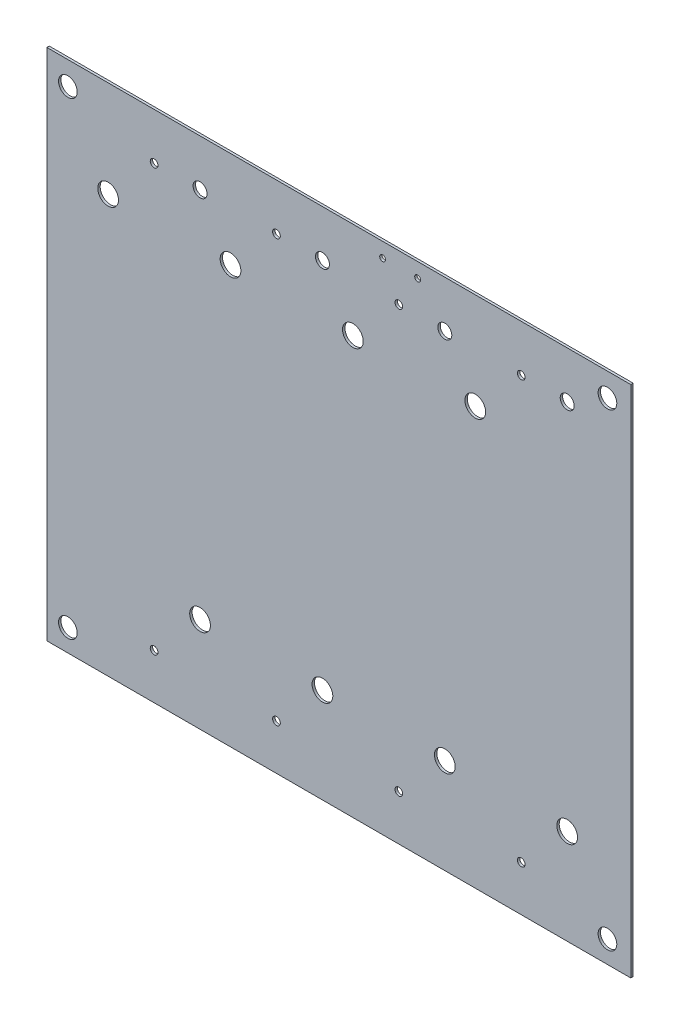
ISO-10303-21;
HEADER;
FILE_DESCRIPTION(('STEP AP214'),'2;1');
FILE_NAME('part.step','',(''),(''),'','','');
FILE_SCHEMA(('AUTOMOTIVE_DESIGN { 1 0 10303 214 1 1 1 1 }'));
ENDSEC;
DATA;
#1=APPLICATION_CONTEXT('core data for automotive mechanical design processes');
#2=APPLICATION_PROTOCOL_DEFINITION('international standard','automotive_design',2000,#1);
#3=PRODUCT_CONTEXT('',#1,'mechanical');
#4=PRODUCT('Part','Part','',(#3));
#5=PRODUCT_RELATED_PRODUCT_CATEGORY('part','',(#4));
#6=PRODUCT_DEFINITION_FORMATION('','',#4);
#7=PRODUCT_DEFINITION_CONTEXT('part definition',#1,'design');
#8=PRODUCT_DEFINITION('design','',#6,#7);
#9=PRODUCT_DEFINITION_SHAPE('','',#8);
#10=(LENGTH_UNIT() NAMED_UNIT(*) SI_UNIT(.MILLI.,.METRE.));
#11=(NAMED_UNIT(*) PLANE_ANGLE_UNIT() SI_UNIT($,.RADIAN.));
#12=(NAMED_UNIT(*) SI_UNIT($,.STERADIAN.) SOLID_ANGLE_UNIT());
#13=UNCERTAINTY_MEASURE_WITH_UNIT(LENGTH_MEASURE(1.E-05),#10,'distance_accuracy_value','');
#14=(GEOMETRIC_REPRESENTATION_CONTEXT(3) GLOBAL_UNCERTAINTY_ASSIGNED_CONTEXT((#13)) GLOBAL_UNIT_ASSIGNED_CONTEXT((#10,
#11,#12)) REPRESENTATION_CONTEXT('',''));
#15=CARTESIAN_POINT('',(0.,0.,0.));
#16=DIRECTION('',(0.,0.,1.));
#17=DIRECTION('',(1.,0.,0.));
#18=AXIS2_PLACEMENT_3D('',#15,#16,#17);
#19=CARTESIAN_POINT('',(117.,60.,0.41148));
#20=DIRECTION('',(0.,0.,-1.));
#21=DIRECTION('',(0.,-1.,0.));
#22=AXIS2_PLACEMENT_3D('',#19,#20,#21);
#23=PLANE('',#22);
#24=CARTESIAN_POINT('',(163.,100.,0.41148));
#25=DIRECTION('',(0.,0.,1.));
#26=DIRECTION('',(1.,0.,0.));
#27=AXIS2_PLACEMENT_3D('',#24,#25,#26);
#28=CIRCLE('',#27,1.6);
#29=CARTESIAN_POINT('',(164.6,100.,0.41148));
#30=VERTEX_POINT('',#29);
#31=EDGE_CURVE('E27',#30,#30,#28,.T.);
#32=ORIENTED_EDGE('',*,*,#31,.F.);
#33=EDGE_LOOP('',(#32));
#34=FACE_BOUND('',#33,.T.);
#35=CARTESIAN_POINT('',(156.108,95.999,0.41148));
#36=DIRECTION('',(0.,0.,1.));
#37=DIRECTION('',(1.,0.,0.));
#38=AXIS2_PLACEMENT_3D('',#35,#36,#37);
#39=CIRCLE('',#38,1.195);
#40=CARTESIAN_POINT('',(157.303,95.999,0.41148));
#41=VERTEX_POINT('',#40);
#42=EDGE_CURVE('E20',#41,#41,#39,.T.);
#43=ORIENTED_EDGE('',*,*,#42,.F.);
#44=EDGE_LOOP('',(#43));
#45=FACE_BOUND('',#44,.T.);
#46=CARTESIAN_POINT('',(148.238,95.999,0.41148));
#47=DIRECTION('',(0.,0.,1.));
#48=DIRECTION('',(1.,0.,0.));
#49=AXIS2_PLACEMENT_3D('',#46,#47,#48);
#50=CIRCLE('',#49,0.66);
#51=CARTESIAN_POINT('',(148.898,95.999,0.41148));
#52=VERTEX_POINT('',#51);
#53=EDGE_CURVE('E192',#52,#52,#50,.T.);
#54=ORIENTED_EDGE('',*,*,#53,.F.);
#55=EDGE_LOOP('',(#54));
#56=FACE_BOUND('',#55,.T.);
#57=CARTESIAN_POINT('',(135.153,95.999,0.41148));
#58=DIRECTION('',(0.,0.,1.));
#59=DIRECTION('',(1.,0.,0.));
#60=AXIS2_PLACEMENT_3D('',#57,#58,#59);
#61=CIRCLE('',#60,1.195);
#62=CARTESIAN_POINT('',(136.348,95.999,0.41148));
#63=VERTEX_POINT('',#62);
#64=EDGE_CURVE('E230',#63,#63,#61,.T.);
#65=ORIENTED_EDGE('',*,*,#64,.F.);
#66=EDGE_LOOP('',(#65));
#67=FACE_BOUND('',#66,.T.);
#68=CARTESIAN_POINT('',(130.5,101.5,0.41148));
#69=DIRECTION('',(0.,0.,1.));
#70=DIRECTION('',(1.,0.,0.));
#71=AXIS2_PLACEMENT_3D('',#68,#69,#70);
#72=CIRCLE('',#71,0.5);
#73=CARTESIAN_POINT('',(131.,101.5,0.41148));
#74=VERTEX_POINT('',#73);
#75=EDGE_CURVE('E281',#74,#74,#72,.T.);
#76=ORIENTED_EDGE('',*,*,#75,.F.);
#77=EDGE_LOOP('',(#76));
#78=FACE_BOUND('',#77,.T.);
#79=CARTESIAN_POINT('',(124.5,101.5,0.41148));
#80=DIRECTION('',(0.,0.,1.));
#81=DIRECTION('',(1.,0.,0.));
#82=AXIS2_PLACEMENT_3D('',#79,#80,#81);
#83=CIRCLE('',#82,0.5);
#84=CARTESIAN_POINT('',(125.,101.5,0.41148));
#85=VERTEX_POINT('',#84);
#86=EDGE_CURVE('E122',#85,#85,#83,.T.);
#87=ORIENTED_EDGE('',*,*,#86,.F.);
#88=EDGE_LOOP('',(#87));
#89=FACE_BOUND('',#88,.T.);
#90=CARTESIAN_POINT('',(127.283,95.999,0.41148));
#91=DIRECTION('',(0.,0.,1.));
#92=DIRECTION('',(1.,0.,0.));
#93=AXIS2_PLACEMENT_3D('',#90,#91,#92);
#94=CIRCLE('',#93,0.66);
#95=CARTESIAN_POINT('',(127.943,95.999,0.41148));
#96=VERTEX_POINT('',#95);
#97=EDGE_CURVE('E206',#96,#96,#94,.T.);
#98=ORIENTED_EDGE('',*,*,#97,.F.);
#99=EDGE_LOOP('',(#98));
#100=FACE_BOUND('',#99,.T.);
#101=CARTESIAN_POINT('',(156.108,32.289,0.41148));
#102=DIRECTION('',(0.,0.,1.));
#103=DIRECTION('',(1.,0.,0.));
#104=AXIS2_PLACEMENT_3D('',#101,#102,#103);
#105=CIRCLE('',#104,1.775);
#106=CARTESIAN_POINT('',(157.883,32.289,0.41148));
#107=VERTEX_POINT('',#106);
#108=EDGE_CURVE('E207',#107,#107,#105,.T.);
#109=ORIENTED_EDGE('',*,*,#108,.F.);
#110=EDGE_LOOP('',(#109));
#111=FACE_BOUND('',#110,.T.);
#112=CARTESIAN_POINT('',(148.238,23.779,0.41148));
#113=DIRECTION('',(0.,0.,1.));
#114=DIRECTION('',(1.,0.,0.));
#115=AXIS2_PLACEMENT_3D('',#112,#113,#114);
#116=CIRCLE('',#115,0.66);
#117=CARTESIAN_POINT('',(148.898,23.779,0.41148));
#118=VERTEX_POINT('',#117);
#119=EDGE_CURVE('E239',#118,#118,#116,.T.);
#120=ORIENTED_EDGE('',*,*,#119,.F.);
#121=EDGE_LOOP('',(#120));
#122=FACE_BOUND('',#121,.T.);
#123=CARTESIAN_POINT('',(163.,19.778,0.41148));
#124=DIRECTION('',(0.,0.,1.));
#125=DIRECTION('',(1.,0.,0.));
#126=AXIS2_PLACEMENT_3D('',#123,#124,#125);
#127=CIRCLE('',#126,1.6);
#128=CARTESIAN_POINT('',(164.6,19.778,0.41148));
#129=VERTEX_POINT('',#128);
#130=EDGE_CURVE('E240',#129,#129,#127,.T.);
#131=ORIENTED_EDGE('',*,*,#130,.F.);
#132=EDGE_LOOP('',(#131));
#133=FACE_BOUND('',#132,.T.);
#134=CARTESIAN_POINT('',(140.368,87.489,0.41148));
#135=DIRECTION('',(0.,0.,1.));
#136=DIRECTION('',(1.,0.,0.));
#137=AXIS2_PLACEMENT_3D('',#134,#135,#136);
#138=CIRCLE('',#137,1.775);
#139=CARTESIAN_POINT('',(142.143,87.489,0.41148));
#140=VERTEX_POINT('',#139);
#141=EDGE_CURVE('E274',#140,#140,#138,.T.);
#142=ORIENTED_EDGE('',*,*,#141,.F.);
#143=EDGE_LOOP('',(#142));
#144=FACE_BOUND('',#143,.T.);
#145=CARTESIAN_POINT('',(135.153,32.289,0.41148));
#146=DIRECTION('',(0.,0.,1.));
#147=DIRECTION('',(1.,0.,0.));
#148=AXIS2_PLACEMENT_3D('',#145,#146,#147);
#149=CIRCLE('',#148,1.775);
#150=CARTESIAN_POINT('',(136.928,32.289,0.41148));
#151=VERTEX_POINT('',#150);
#152=EDGE_CURVE('E259',#151,#151,#149,.T.);
#153=ORIENTED_EDGE('',*,*,#152,.F.);
#154=EDGE_LOOP('',(#153));
#155=FACE_BOUND('',#154,.T.);
#156=CARTESIAN_POINT('',(127.283,23.779,0.41148));
#157=DIRECTION('',(0.,0.,1.));
#158=DIRECTION('',(1.,0.,0.));
#159=AXIS2_PLACEMENT_3D('',#156,#157,#158);
#160=CIRCLE('',#159,0.66);
#161=CARTESIAN_POINT('',(127.943,23.779,0.41148));
#162=VERTEX_POINT('',#161);
#163=EDGE_CURVE('E254',#162,#162,#160,.T.);
#164=ORIENTED_EDGE('',*,*,#163,.F.);
#165=EDGE_LOOP('',(#164));
#166=FACE_BOUND('',#165,.T.);
#167=CARTESIAN_POINT('',(114.198,95.999,0.41148));
#168=DIRECTION('',(0.,0.,1.));
#169=DIRECTION('',(1.,0.,0.));
#170=AXIS2_PLACEMENT_3D('',#167,#168,#169);
#171=CIRCLE('',#170,1.195);
#172=CARTESIAN_POINT('',(115.393,95.999,0.41148));
#173=VERTEX_POINT('',#172);
#174=EDGE_CURVE('E157',#173,#173,#171,.T.);
#175=ORIENTED_EDGE('',*,*,#174,.F.);
#176=EDGE_LOOP('',(#175));
#177=FACE_BOUND('',#176,.T.);
#178=CARTESIAN_POINT('',(106.328,95.999,0.41148));
#179=DIRECTION('',(0.,0.,1.));
#180=DIRECTION('',(1.,0.,0.));
#181=AXIS2_PLACEMENT_3D('',#178,#179,#180);
#182=CIRCLE('',#181,0.66);
#183=CARTESIAN_POINT('',(106.988,95.999,0.41148));
#184=VERTEX_POINT('',#183);
#185=EDGE_CURVE('E234',#184,#184,#182,.T.);
#186=ORIENTED_EDGE('',*,*,#185,.F.);
#187=EDGE_LOOP('',(#186));
#188=FACE_BOUND('',#187,.T.);
#189=CARTESIAN_POINT('',(119.413,87.489,0.41148));
#190=DIRECTION('',(0.,0.,1.));
#191=DIRECTION('',(1.,0.,0.));
#192=AXIS2_PLACEMENT_3D('',#189,#190,#191);
#193=CIRCLE('',#192,1.775);
#194=CARTESIAN_POINT('',(121.188,87.489,0.41148));
#195=VERTEX_POINT('',#194);
#196=EDGE_CURVE('E222',#195,#195,#193,.T.);
#197=ORIENTED_EDGE('',*,*,#196,.F.);
#198=EDGE_LOOP('',(#197));
#199=FACE_BOUND('',#198,.T.);
#200=CARTESIAN_POINT('',(98.458,87.489,0.41148));
#201=DIRECTION('',(0.,0.,1.));
#202=DIRECTION('',(1.,0.,0.));
#203=AXIS2_PLACEMENT_3D('',#200,#201,#202);
#204=CIRCLE('',#203,1.775);
#205=CARTESIAN_POINT('',(100.233,87.489,0.41148));
#206=VERTEX_POINT('',#205);
#207=EDGE_CURVE('E211',#206,#206,#204,.T.);
#208=ORIENTED_EDGE('',*,*,#207,.F.);
#209=EDGE_LOOP('',(#208));
#210=FACE_BOUND('',#209,.T.);
#211=CARTESIAN_POINT('',(93.243,95.999,0.41148));
#212=DIRECTION('',(0.,0.,1.));
#213=DIRECTION('',(1.,0.,0.));
#214=AXIS2_PLACEMENT_3D('',#211,#212,#213);
#215=CIRCLE('',#214,1.195);
#216=CARTESIAN_POINT('',(94.438,95.999,0.41148));
#217=VERTEX_POINT('',#216);
#218=EDGE_CURVE('E188',#217,#217,#215,.T.);
#219=ORIENTED_EDGE('',*,*,#218,.F.);
#220=EDGE_LOOP('',(#219));
#221=FACE_BOUND('',#220,.T.);
#222=CARTESIAN_POINT('',(70.61,100.,0.41148));
#223=DIRECTION('',(0.,0.,1.));
#224=DIRECTION('',(1.,0.,0.));
#225=AXIS2_PLACEMENT_3D('',#222,#223,#224);
#226=CIRCLE('',#225,1.6);
#227=CARTESIAN_POINT('',(72.21,100.,0.41148));
#228=VERTEX_POINT('',#227);
#229=EDGE_CURVE('E180',#228,#228,#226,.T.);
#230=ORIENTED_EDGE('',*,*,#229,.F.);
#231=EDGE_LOOP('',(#230));
#232=FACE_BOUND('',#231,.T.);
#233=CARTESIAN_POINT('',(85.373,95.999,0.41148));
#234=DIRECTION('',(0.,0.,1.));
#235=DIRECTION('',(1.,0.,0.));
#236=AXIS2_PLACEMENT_3D('',#233,#234,#235);
#237=CIRCLE('',#236,0.66);
#238=CARTESIAN_POINT('',(86.033,95.999,0.41148));
#239=VERTEX_POINT('',#238);
#240=EDGE_CURVE('E107',#239,#239,#237,.T.);
#241=ORIENTED_EDGE('',*,*,#240,.F.);
#242=EDGE_LOOP('',(#241));
#243=FACE_BOUND('',#242,.T.);
#244=CARTESIAN_POINT('',(114.198,32.289,0.41148));
#245=DIRECTION('',(0.,0.,1.));
#246=DIRECTION('',(1.,0.,0.));
#247=AXIS2_PLACEMENT_3D('',#244,#245,#246);
#248=CIRCLE('',#247,1.775);
#249=CARTESIAN_POINT('',(115.973,32.289,0.41148));
#250=VERTEX_POINT('',#249);
#251=EDGE_CURVE('E108',#250,#250,#248,.T.);
#252=ORIENTED_EDGE('',*,*,#251,.F.);
#253=EDGE_LOOP('',(#252));
#254=FACE_BOUND('',#253,.T.);
#255=CARTESIAN_POINT('',(93.243,32.289,0.41148));
#256=DIRECTION('',(0.,0.,1.));
#257=DIRECTION('',(1.,0.,0.));
#258=AXIS2_PLACEMENT_3D('',#255,#256,#257);
#259=CIRCLE('',#258,1.775);
#260=CARTESIAN_POINT('',(95.018,32.289,0.41148));
#261=VERTEX_POINT('',#260);
#262=EDGE_CURVE('E156',#261,#261,#259,.T.);
#263=ORIENTED_EDGE('',*,*,#262,.F.);
#264=EDGE_LOOP('',(#263));
#265=FACE_BOUND('',#264,.T.);
#266=CARTESIAN_POINT('',(106.328,23.779,0.41148));
#267=DIRECTION('',(0.,0.,1.));
#268=DIRECTION('',(1.,0.,0.));
#269=AXIS2_PLACEMENT_3D('',#266,#267,#268);
#270=CIRCLE('',#269,0.66);
#271=CARTESIAN_POINT('',(106.988,23.779,0.41148));
#272=VERTEX_POINT('',#271);
#273=EDGE_CURVE('E144',#272,#272,#270,.T.);
#274=ORIENTED_EDGE('',*,*,#273,.F.);
#275=EDGE_LOOP('',(#274));
#276=FACE_BOUND('',#275,.T.);
#277=CARTESIAN_POINT('',(85.373,23.779,0.41148));
#278=DIRECTION('',(0.,0.,1.));
#279=DIRECTION('',(1.,0.,0.));
#280=AXIS2_PLACEMENT_3D('',#277,#278,#279);
#281=CIRCLE('',#280,0.66);
#282=CARTESIAN_POINT('',(86.033,23.779,0.41148));
#283=VERTEX_POINT('',#282);
#284=EDGE_CURVE('E136',#283,#283,#281,.T.);
#285=ORIENTED_EDGE('',*,*,#284,.F.);
#286=EDGE_LOOP('',(#285));
#287=FACE_BOUND('',#286,.T.);
#288=CARTESIAN_POINT('',(77.503,87.489,0.41148));
#289=DIRECTION('',(0.,0.,1.));
#290=DIRECTION('',(1.,0.,0.));
#291=AXIS2_PLACEMENT_3D('',#288,#289,#290);
#292=CIRCLE('',#291,1.775);
#293=CARTESIAN_POINT('',(79.278,87.489,0.41148));
#294=VERTEX_POINT('',#293);
#295=EDGE_CURVE('E128',#294,#294,#292,.T.);
#296=ORIENTED_EDGE('',*,*,#295,.F.);
#297=EDGE_LOOP('',(#296));
#298=FACE_BOUND('',#297,.T.);
#299=CARTESIAN_POINT('',(70.61,19.778,0.41148));
#300=DIRECTION('',(0.,0.,1.));
#301=DIRECTION('',(1.,0.,0.));
#302=AXIS2_PLACEMENT_3D('',#299,#300,#301);
#303=CIRCLE('',#302,1.6);
#304=CARTESIAN_POINT('',(72.21,19.778,0.41148));
#305=VERTEX_POINT('',#304);
#306=EDGE_CURVE('E113',#305,#305,#303,.T.);
#307=ORIENTED_EDGE('',*,*,#306,.F.);
#308=EDGE_LOOP('',(#307));
#309=FACE_BOUND('',#308,.T.);
#310=DIRECTION('',(-1.,0.,0.));
#311=VECTOR('',#310,1.);
#312=CARTESIAN_POINT('',(167.,16.,0.41148));
#313=LINE('',#312,#311);
#314=CARTESIAN_POINT('',(167.,16.,0.41148));
#315=VERTEX_POINT('',#314);
#316=CARTESIAN_POINT('',(67.,16.,0.41148));
#317=VERTEX_POINT('',#316);
#318=EDGE_CURVE('E78',#315,#317,#313,.T.);
#319=ORIENTED_EDGE('',*,*,#318,.F.);
#320=DIRECTION('',(0.,-1.,0.));
#321=VECTOR('',#320,1.);
#322=CARTESIAN_POINT('',(167.,104.,0.41148));
#323=LINE('',#322,#321);
#324=CARTESIAN_POINT('',(167.,104.,0.41148));
#325=VERTEX_POINT('',#324);
#326=EDGE_CURVE('E72',#325,#315,#323,.T.);
#327=ORIENTED_EDGE('',*,*,#326,.F.);
#328=DIRECTION('',(1.,0.,0.));
#329=VECTOR('',#328,1.);
#330=CARTESIAN_POINT('',(67.,104.,0.41148));
#331=LINE('',#330,#329);
#332=CARTESIAN_POINT('',(67.,104.,0.41148));
#333=VERTEX_POINT('',#332);
#334=EDGE_CURVE('E76',#333,#325,#331,.T.);
#335=ORIENTED_EDGE('',*,*,#334,.F.);
#336=DIRECTION('',(0.,1.,0.));
#337=VECTOR('',#336,1.);
#338=CARTESIAN_POINT('',(67.,16.,0.41148));
#339=LINE('',#338,#337);
#340=EDGE_CURVE('E311',#317,#333,#339,.T.);
#341=ORIENTED_EDGE('',*,*,#340,.F.);
#342=EDGE_LOOP('',(#319,#327,#335,#341));
#343=FACE_BOUND('',#342,.T.);
#344=ADVANCED_FACE('F17',(#34,#45,#56,#67,#78,#89,#100,#111,#122,#133,#144,#155,#166,#177,#188,
#199,#210,#221,#232,#243,#254,#265,#276,#287,#298,#309,#343),#23,.F.);
#345=CARTESIAN_POINT('',(117.,60.,0.));
#346=DIRECTION('',(0.,0.,-1.));
#347=DIRECTION('',(0.,-1.,0.));
#348=AXIS2_PLACEMENT_3D('',#345,#346,#347);
#349=PLANE('',#348);
#350=CARTESIAN_POINT('',(163.,100.,0.));
#351=DIRECTION('',(0.,0.,1.));
#352=DIRECTION('',(1.,0.,0.));
#353=AXIS2_PLACEMENT_3D('',#350,#351,#352);
#354=CIRCLE('',#353,1.6);
#355=CARTESIAN_POINT('',(164.6,100.,0.));
#356=VERTEX_POINT('',#355);
#357=EDGE_CURVE('E11',#356,#356,#354,.T.);
#358=ORIENTED_EDGE('',*,*,#357,.T.);
#359=EDGE_LOOP('',(#358));
#360=FACE_BOUND('',#359,.T.);
#361=CARTESIAN_POINT('',(156.108,95.999,0.));
#362=DIRECTION('',(0.,0.,1.));
#363=DIRECTION('',(1.,0.,0.));
#364=AXIS2_PLACEMENT_3D('',#361,#362,#363);
#365=CIRCLE('',#364,1.195);
#366=CARTESIAN_POINT('',(157.303,95.999,0.));
#367=VERTEX_POINT('',#366);
#368=EDGE_CURVE('E152',#367,#367,#365,.T.);
#369=ORIENTED_EDGE('',*,*,#368,.T.);
#370=EDGE_LOOP('',(#369));
#371=FACE_BOUND('',#370,.T.);
#372=CARTESIAN_POINT('',(148.238,95.999,0.));
#373=DIRECTION('',(0.,0.,1.));
#374=DIRECTION('',(1.,0.,0.));
#375=AXIS2_PLACEMENT_3D('',#372,#373,#374);
#376=CIRCLE('',#375,0.66);
#377=CARTESIAN_POINT('',(148.898,95.999,0.));
#378=VERTEX_POINT('',#377);
#379=EDGE_CURVE('E196',#378,#378,#376,.T.);
#380=ORIENTED_EDGE('',*,*,#379,.T.);
#381=EDGE_LOOP('',(#380));
#382=FACE_BOUND('',#381,.T.);
#383=CARTESIAN_POINT('',(135.153,95.999,0.));
#384=DIRECTION('',(0.,0.,1.));
#385=DIRECTION('',(1.,0.,0.));
#386=AXIS2_PLACEMENT_3D('',#383,#384,#385);
#387=CIRCLE('',#386,1.195);
#388=CARTESIAN_POINT('',(136.348,95.999,0.));
#389=VERTEX_POINT('',#388);
#390=EDGE_CURVE('E197',#389,#389,#387,.T.);
#391=ORIENTED_EDGE('',*,*,#390,.T.);
#392=EDGE_LOOP('',(#391));
#393=FACE_BOUND('',#392,.T.);
#394=CARTESIAN_POINT('',(130.5,101.5,0.));
#395=DIRECTION('',(0.,0.,1.));
#396=DIRECTION('',(1.,0.,0.));
#397=AXIS2_PLACEMENT_3D('',#394,#395,#396);
#398=CIRCLE('',#397,0.5);
#399=CARTESIAN_POINT('',(131.,101.5,0.));
#400=VERTEX_POINT('',#399);
#401=EDGE_CURVE('E285',#400,#400,#398,.T.);
#402=ORIENTED_EDGE('',*,*,#401,.T.);
#403=EDGE_LOOP('',(#402));
#404=FACE_BOUND('',#403,.T.);
#405=CARTESIAN_POINT('',(124.5,101.5,0.));
#406=DIRECTION('',(0.,0.,1.));
#407=DIRECTION('',(1.,0.,0.));
#408=AXIS2_PLACEMENT_3D('',#405,#406,#407);
#409=CIRCLE('',#408,0.5);
#410=CARTESIAN_POINT('',(125.,101.5,0.));
#411=VERTEX_POINT('',#410);
#412=EDGE_CURVE('E126',#411,#411,#409,.T.);
#413=ORIENTED_EDGE('',*,*,#412,.T.);
#414=EDGE_LOOP('',(#413));
#415=FACE_BOUND('',#414,.T.);
#416=CARTESIAN_POINT('',(127.283,95.999,0.));
#417=DIRECTION('',(0.,0.,1.));
#418=DIRECTION('',(1.,0.,0.));
#419=AXIS2_PLACEMENT_3D('',#416,#417,#418);
#420=CIRCLE('',#419,0.66);
#421=CARTESIAN_POINT('',(127.943,95.999,0.));
#422=VERTEX_POINT('',#421);
#423=EDGE_CURVE('E127',#422,#422,#420,.T.);
#424=ORIENTED_EDGE('',*,*,#423,.T.);
#425=EDGE_LOOP('',(#424));
#426=FACE_BOUND('',#425,.T.);
#427=CARTESIAN_POINT('',(156.108,32.289,0.));
#428=DIRECTION('',(0.,0.,1.));
#429=DIRECTION('',(1.,0.,0.));
#430=AXIS2_PLACEMENT_3D('',#427,#428,#429);
#431=CIRCLE('',#430,1.775);
#432=CARTESIAN_POINT('',(157.883,32.289,0.));
#433=VERTEX_POINT('',#432);
#434=EDGE_CURVE('E202',#433,#433,#431,.T.);
#435=ORIENTED_EDGE('',*,*,#434,.T.);
#436=EDGE_LOOP('',(#435));
#437=FACE_BOUND('',#436,.T.);
#438=CARTESIAN_POINT('',(148.238,23.779,0.));
#439=DIRECTION('',(0.,0.,1.));
#440=DIRECTION('',(1.,0.,0.));
#441=AXIS2_PLACEMENT_3D('',#438,#439,#440);
#442=CIRCLE('',#441,0.66);
#443=CARTESIAN_POINT('',(148.898,23.779,0.));
#444=VERTEX_POINT('',#443);
#445=EDGE_CURVE('E267',#444,#444,#442,.T.);
#446=ORIENTED_EDGE('',*,*,#445,.T.);
#447=EDGE_LOOP('',(#446));
#448=FACE_BOUND('',#447,.T.);
#449=CARTESIAN_POINT('',(163.,19.778,0.));
#450=DIRECTION('',(0.,0.,1.));
#451=DIRECTION('',(1.,0.,0.));
#452=AXIS2_PLACEMENT_3D('',#449,#450,#451);
#453=CIRCLE('',#452,1.6);
#454=CARTESIAN_POINT('',(164.6,19.778,0.));
#455=VERTEX_POINT('',#454);
#456=EDGE_CURVE('E235',#455,#455,#453,.T.);
#457=ORIENTED_EDGE('',*,*,#456,.T.);
#458=EDGE_LOOP('',(#457));
#459=FACE_BOUND('',#458,.T.);
#460=CARTESIAN_POINT('',(140.368,87.489,0.));
#461=DIRECTION('',(0.,0.,1.));
#462=DIRECTION('',(1.,0.,0.));
#463=AXIS2_PLACEMENT_3D('',#460,#461,#462);
#464=CIRCLE('',#463,1.775);
#465=CARTESIAN_POINT('',(142.143,87.489,0.));
#466=VERTEX_POINT('',#465);
#467=EDGE_CURVE('E244',#466,#466,#464,.T.);
#468=ORIENTED_EDGE('',*,*,#467,.T.);
#469=EDGE_LOOP('',(#468));
#470=FACE_BOUND('',#469,.T.);
#471=CARTESIAN_POINT('',(135.153,32.289,0.));
#472=DIRECTION('',(0.,0.,1.));
#473=DIRECTION('',(1.,0.,0.));
#474=AXIS2_PLACEMENT_3D('',#471,#472,#473);
#475=CIRCLE('',#474,1.775);
#476=CARTESIAN_POINT('',(136.928,32.289,0.));
#477=VERTEX_POINT('',#476);
#478=EDGE_CURVE('E263',#477,#477,#475,.T.);
#479=ORIENTED_EDGE('',*,*,#478,.T.);
#480=EDGE_LOOP('',(#479));
#481=FACE_BOUND('',#480,.T.);
#482=CARTESIAN_POINT('',(127.283,23.779,0.));
#483=DIRECTION('',(0.,0.,1.));
#484=DIRECTION('',(1.,0.,0.));
#485=AXIS2_PLACEMENT_3D('',#482,#483,#484);
#486=CIRCLE('',#485,0.66);
#487=CARTESIAN_POINT('',(127.943,23.779,0.));
#488=VERTEX_POINT('',#487);
#489=EDGE_CURVE('E255',#488,#488,#486,.T.);
#490=ORIENTED_EDGE('',*,*,#489,.T.);
#491=EDGE_LOOP('',(#490));
#492=FACE_BOUND('',#491,.T.);
#493=CARTESIAN_POINT('',(114.198,95.999,0.));
#494=DIRECTION('',(0.,0.,1.));
#495=DIRECTION('',(1.,0.,0.));
#496=AXIS2_PLACEMENT_3D('',#493,#494,#495);
#497=CIRCLE('',#496,1.195);
#498=CARTESIAN_POINT('',(115.393,95.999,0.));
#499=VERTEX_POINT('',#498);
#500=EDGE_CURVE('E161',#499,#499,#497,.T.);
#501=ORIENTED_EDGE('',*,*,#500,.T.);
#502=EDGE_LOOP('',(#501));
#503=FACE_BOUND('',#502,.T.);
#504=CARTESIAN_POINT('',(106.328,95.999,0.));
#505=DIRECTION('',(0.,0.,1.));
#506=DIRECTION('',(1.,0.,0.));
#507=AXIS2_PLACEMENT_3D('',#504,#505,#506);
#508=CIRCLE('',#507,0.66);
#509=CARTESIAN_POINT('',(106.988,95.999,0.));
#510=VERTEX_POINT('',#509);
#511=EDGE_CURVE('E162',#510,#510,#508,.T.);
#512=ORIENTED_EDGE('',*,*,#511,.T.);
#513=EDGE_LOOP('',(#512));
#514=FACE_BOUND('',#513,.T.);
#515=CARTESIAN_POINT('',(119.413,87.489,0.));
#516=DIRECTION('',(0.,0.,1.));
#517=DIRECTION('',(1.,0.,0.));
#518=AXIS2_PLACEMENT_3D('',#515,#516,#517);
#519=CIRCLE('',#518,1.775);
#520=CARTESIAN_POINT('',(121.188,87.489,0.));
#521=VERTEX_POINT('',#520);
#522=EDGE_CURVE('E226',#521,#521,#519,.T.);
#523=ORIENTED_EDGE('',*,*,#522,.T.);
#524=EDGE_LOOP('',(#523));
#525=FACE_BOUND('',#524,.T.);
#526=CARTESIAN_POINT('',(98.458,87.489,0.));
#527=DIRECTION('',(0.,0.,1.));
#528=DIRECTION('',(1.,0.,0.));
#529=AXIS2_PLACEMENT_3D('',#526,#527,#528);
#530=CIRCLE('',#529,1.775);
#531=CARTESIAN_POINT('',(100.233,87.489,0.));
#532=VERTEX_POINT('',#531);
#533=EDGE_CURVE('E218',#532,#532,#530,.T.);
#534=ORIENTED_EDGE('',*,*,#533,.T.);
#535=EDGE_LOOP('',(#534));
#536=FACE_BOUND('',#535,.T.);
#537=CARTESIAN_POINT('',(93.243,95.999,0.));
#538=DIRECTION('',(0.,0.,1.));
#539=DIRECTION('',(1.,0.,0.));
#540=AXIS2_PLACEMENT_3D('',#537,#538,#539);
#541=CIRCLE('',#540,1.195);
#542=CARTESIAN_POINT('',(94.438,95.999,0.));
#543=VERTEX_POINT('',#542);
#544=EDGE_CURVE('E200',#543,#543,#541,.T.);
#545=ORIENTED_EDGE('',*,*,#544,.T.);
#546=EDGE_LOOP('',(#545));
#547=FACE_BOUND('',#546,.T.);
#548=CARTESIAN_POINT('',(70.61,100.,0.));
#549=DIRECTION('',(0.,0.,1.));
#550=DIRECTION('',(1.,0.,0.));
#551=AXIS2_PLACEMENT_3D('',#548,#549,#550);
#552=CIRCLE('',#551,1.6);
#553=CARTESIAN_POINT('',(72.21,100.,0.));
#554=VERTEX_POINT('',#553);
#555=EDGE_CURVE('E184',#554,#554,#552,.T.);
#556=ORIENTED_EDGE('',*,*,#555,.T.);
#557=EDGE_LOOP('',(#556));
#558=FACE_BOUND('',#557,.T.);
#559=CARTESIAN_POINT('',(85.373,95.999,0.));
#560=DIRECTION('',(0.,0.,1.));
#561=DIRECTION('',(1.,0.,0.));
#562=AXIS2_PLACEMENT_3D('',#559,#560,#561);
#563=CIRCLE('',#562,0.66);
#564=CARTESIAN_POINT('',(86.033,95.999,0.));
#565=VERTEX_POINT('',#564);
#566=EDGE_CURVE('E176',#565,#565,#563,.T.);
#567=ORIENTED_EDGE('',*,*,#566,.T.);
#568=EDGE_LOOP('',(#567));
#569=FACE_BOUND('',#568,.T.);
#570=CARTESIAN_POINT('',(114.198,32.289,0.));
#571=DIRECTION('',(0.,0.,1.));
#572=DIRECTION('',(1.,0.,0.));
#573=AXIS2_PLACEMENT_3D('',#570,#571,#572);
#574=CIRCLE('',#573,1.775);
#575=CARTESIAN_POINT('',(115.973,32.289,0.));
#576=VERTEX_POINT('',#575);
#577=EDGE_CURVE('E103',#576,#576,#574,.T.);
#578=ORIENTED_EDGE('',*,*,#577,.T.);
#579=EDGE_LOOP('',(#578));
#580=FACE_BOUND('',#579,.T.);
#581=CARTESIAN_POINT('',(93.243,32.289,0.));
#582=DIRECTION('',(0.,0.,1.));
#583=DIRECTION('',(1.,0.,0.));
#584=AXIS2_PLACEMENT_3D('',#581,#582,#583);
#585=CIRCLE('',#584,1.775);
#586=CARTESIAN_POINT('',(95.018,32.289,0.));
#587=VERTEX_POINT('',#586);
#588=EDGE_CURVE('E166',#587,#587,#585,.T.);
#589=ORIENTED_EDGE('',*,*,#588,.T.);
#590=EDGE_LOOP('',(#589));
#591=FACE_BOUND('',#590,.T.);
#592=CARTESIAN_POINT('',(106.328,23.779,0.));
#593=DIRECTION('',(0.,0.,1.));
#594=DIRECTION('',(1.,0.,0.));
#595=AXIS2_PLACEMENT_3D('',#592,#593,#594);
#596=CIRCLE('',#595,0.66);
#597=CARTESIAN_POINT('',(106.988,23.779,0.));
#598=VERTEX_POINT('',#597);
#599=EDGE_CURVE('E148',#598,#598,#596,.T.);
#600=ORIENTED_EDGE('',*,*,#599,.T.);
#601=EDGE_LOOP('',(#600));
#602=FACE_BOUND('',#601,.T.);
#603=CARTESIAN_POINT('',(85.373,23.779,0.));
#604=DIRECTION('',(0.,0.,1.));
#605=DIRECTION('',(1.,0.,0.));
#606=AXIS2_PLACEMENT_3D('',#603,#604,#605);
#607=CIRCLE('',#606,0.66);
#608=CARTESIAN_POINT('',(86.033,23.779,0.));
#609=VERTEX_POINT('',#608);
#610=EDGE_CURVE('E140',#609,#609,#607,.T.);
#611=ORIENTED_EDGE('',*,*,#610,.T.);
#612=EDGE_LOOP('',(#611));
#613=FACE_BOUND('',#612,.T.);
#614=CARTESIAN_POINT('',(77.503,87.489,0.));
#615=DIRECTION('',(0.,0.,1.));
#616=DIRECTION('',(1.,0.,0.));
#617=AXIS2_PLACEMENT_3D('',#614,#615,#616);
#618=CIRCLE('',#617,1.775);
#619=CARTESIAN_POINT('',(79.278,87.489,0.));
#620=VERTEX_POINT('',#619);
#621=EDGE_CURVE('E132',#620,#620,#618,.T.);
#622=ORIENTED_EDGE('',*,*,#621,.T.);
#623=EDGE_LOOP('',(#622));
#624=FACE_BOUND('',#623,.T.);
#625=CARTESIAN_POINT('',(70.61,19.778,0.));
#626=DIRECTION('',(0.,0.,1.));
#627=DIRECTION('',(1.,0.,0.));
#628=AXIS2_PLACEMENT_3D('',#625,#626,#627);
#629=CIRCLE('',#628,1.6);
#630=CARTESIAN_POINT('',(72.21,19.778,0.));
#631=VERTEX_POINT('',#630);
#632=EDGE_CURVE('E117',#631,#631,#629,.T.);
#633=ORIENTED_EDGE('',*,*,#632,.T.);
#634=EDGE_LOOP('',(#633));
#635=FACE_BOUND('',#634,.T.);
#636=DIRECTION('',(0.,1.,0.));
#637=VECTOR('',#636,1.);
#638=CARTESIAN_POINT('',(67.,16.,0.));
#639=LINE('',#638,#637);
#640=CARTESIAN_POINT('',(67.,16.,0.));
#641=VERTEX_POINT('',#640);
#642=CARTESIAN_POINT('',(67.,104.,0.));
#643=VERTEX_POINT('',#642);
#644=EDGE_CURVE('E94',#641,#643,#639,.T.);
#645=ORIENTED_EDGE('',*,*,#644,.T.);
#646=DIRECTION('',(1.,0.,0.));
#647=VECTOR('',#646,1.);
#648=CARTESIAN_POINT('',(67.,104.,0.));
#649=LINE('',#648,#647);
#650=CARTESIAN_POINT('',(167.,104.,0.));
#651=VERTEX_POINT('',#650);
#652=EDGE_CURVE('E64',#643,#651,#649,.T.);
#653=ORIENTED_EDGE('',*,*,#652,.T.);
#654=DIRECTION('',(0.,-1.,0.));
#655=VECTOR('',#654,1.);
#656=CARTESIAN_POINT('',(167.,104.,0.));
#657=LINE('',#656,#655);
#658=CARTESIAN_POINT('',(167.,16.,0.));
#659=VERTEX_POINT('',#658);
#660=EDGE_CURVE('E86',#651,#659,#657,.T.);
#661=ORIENTED_EDGE('',*,*,#660,.T.);
#662=DIRECTION('',(-1.,0.,0.));
#663=VECTOR('',#662,1.);
#664=CARTESIAN_POINT('',(167.,16.,0.));
#665=LINE('',#664,#663);
#666=EDGE_CURVE('E41',#659,#641,#665,.T.);
#667=ORIENTED_EDGE('',*,*,#666,.T.);
#668=EDGE_LOOP('',(#645,#653,#661,#667));
#669=FACE_BOUND('',#668,.T.);
#670=ADVANCED_FACE('F649',(#360,#371,#382,#393,#404,#415,#426,#437,#448,#459,#470,#481,#492,
#503,#514,#525,#536,#547,#558,#569,#580,#591,#602,#613,#624,#635,#669),#349,.T.);
#671=CARTESIAN_POINT('',(163.,100.,0.));
#672=DIRECTION('',(0.,0.,-1.));
#673=DIRECTION('',(1.,0.,0.));
#674=AXIS2_PLACEMENT_3D('',#671,#672,#673);
#675=CYLINDRICAL_SURFACE('',#674,1.6);
#676=ORIENTED_EDGE('',*,*,#31,.T.);
#677=EDGE_LOOP('',(#676));
#678=FACE_BOUND('',#677,.T.);
#679=ORIENTED_EDGE('',*,*,#357,.F.);
#680=EDGE_LOOP('',(#679));
#681=FACE_BOUND('',#680,.T.);
#682=ADVANCED_FACE('F643',(#678,#681),#675,.F.);
#683=CARTESIAN_POINT('',(156.108,95.999,0.));
#684=DIRECTION('',(0.,0.,-1.));
#685=DIRECTION('',(1.,0.,0.));
#686=AXIS2_PLACEMENT_3D('',#683,#684,#685);
#687=CYLINDRICAL_SURFACE('',#686,1.195);
#688=ORIENTED_EDGE('',*,*,#42,.T.);
#689=EDGE_LOOP('',(#688));
#690=FACE_BOUND('',#689,.T.);
#691=ORIENTED_EDGE('',*,*,#368,.F.);
#692=EDGE_LOOP('',(#691));
#693=FACE_BOUND('',#692,.T.);
#694=ADVANCED_FACE('F648',(#690,#693),#687,.F.);
#695=CARTESIAN_POINT('',(148.238,95.999,0.));
#696=DIRECTION('',(0.,0.,-1.));
#697=DIRECTION('',(1.,0.,0.));
#698=AXIS2_PLACEMENT_3D('',#695,#696,#697);
#699=CYLINDRICAL_SURFACE('',#698,0.66);
#700=ORIENTED_EDGE('',*,*,#53,.T.);
#701=EDGE_LOOP('',(#700));
#702=FACE_BOUND('',#701,.T.);
#703=ORIENTED_EDGE('',*,*,#379,.F.);
#704=EDGE_LOOP('',(#703));
#705=FACE_BOUND('',#704,.T.);
#706=ADVANCED_FACE('F758',(#702,#705),#699,.F.);
#707=CARTESIAN_POINT('',(135.153,95.999,0.));
#708=DIRECTION('',(0.,0.,-1.));
#709=DIRECTION('',(1.,0.,0.));
#710=AXIS2_PLACEMENT_3D('',#707,#708,#709);
#711=CYLINDRICAL_SURFACE('',#710,1.195);
#712=ORIENTED_EDGE('',*,*,#64,.T.);
#713=EDGE_LOOP('',(#712));
#714=FACE_BOUND('',#713,.T.);
#715=ORIENTED_EDGE('',*,*,#390,.F.);
#716=EDGE_LOOP('',(#715));
#717=FACE_BOUND('',#716,.T.);
#718=ADVANCED_FACE('F749',(#714,#717),#711,.F.);
#719=CARTESIAN_POINT('',(130.5,101.5,0.));
#720=DIRECTION('',(0.,0.,-1.));
#721=DIRECTION('',(1.,0.,0.));
#722=AXIS2_PLACEMENT_3D('',#719,#720,#721);
#723=CYLINDRICAL_SURFACE('',#722,0.5);
#724=ORIENTED_EDGE('',*,*,#75,.T.);
#725=EDGE_LOOP('',(#724));
#726=FACE_BOUND('',#725,.T.);
#727=ORIENTED_EDGE('',*,*,#401,.F.);
#728=EDGE_LOOP('',(#727));
#729=FACE_BOUND('',#728,.T.);
#730=ADVANCED_FACE('F732',(#726,#729),#723,.F.);
#731=CARTESIAN_POINT('',(124.5,101.5,0.));
#732=DIRECTION('',(0.,0.,-1.));
#733=DIRECTION('',(1.,0.,0.));
#734=AXIS2_PLACEMENT_3D('',#731,#732,#733);
#735=CYLINDRICAL_SURFACE('',#734,0.5);
#736=ORIENTED_EDGE('',*,*,#86,.T.);
#737=EDGE_LOOP('',(#736));
#738=FACE_BOUND('',#737,.T.);
#739=ORIENTED_EDGE('',*,*,#412,.F.);
#740=EDGE_LOOP('',(#739));
#741=FACE_BOUND('',#740,.T.);
#742=ADVANCED_FACE('F723',(#738,#741),#735,.F.);
#743=CARTESIAN_POINT('',(127.283,95.999,0.));
#744=DIRECTION('',(0.,0.,-1.));
#745=DIRECTION('',(1.,0.,0.));
#746=AXIS2_PLACEMENT_3D('',#743,#744,#745);
#747=CYLINDRICAL_SURFACE('',#746,0.66);
#748=ORIENTED_EDGE('',*,*,#97,.T.);
#749=EDGE_LOOP('',(#748));
#750=FACE_BOUND('',#749,.T.);
#751=ORIENTED_EDGE('',*,*,#423,.F.);
#752=EDGE_LOOP('',(#751));
#753=FACE_BOUND('',#752,.T.);
#754=ADVANCED_FACE('F714',(#750,#753),#747,.F.);
#755=CARTESIAN_POINT('',(156.108,32.289,0.));
#756=DIRECTION('',(0.,0.,-1.));
#757=DIRECTION('',(1.,0.,0.));
#758=AXIS2_PLACEMENT_3D('',#755,#756,#757);
#759=CYLINDRICAL_SURFACE('',#758,1.775);
#760=ORIENTED_EDGE('',*,*,#108,.T.);
#761=EDGE_LOOP('',(#760));
#762=FACE_BOUND('',#761,.T.);
#763=ORIENTED_EDGE('',*,*,#434,.F.);
#764=EDGE_LOOP('',(#763));
#765=FACE_BOUND('',#764,.T.);
#766=ADVANCED_FACE('F705',(#762,#765),#759,.F.);
#767=CARTESIAN_POINT('',(148.238,23.779,0.));
#768=DIRECTION('',(0.,0.,-1.));
#769=DIRECTION('',(1.,0.,0.));
#770=AXIS2_PLACEMENT_3D('',#767,#768,#769);
#771=CYLINDRICAL_SURFACE('',#770,0.66);
#772=ORIENTED_EDGE('',*,*,#119,.T.);
#773=EDGE_LOOP('',(#772));
#774=FACE_BOUND('',#773,.T.);
#775=ORIENTED_EDGE('',*,*,#445,.F.);
#776=EDGE_LOOP('',(#775));
#777=FACE_BOUND('',#776,.T.);
#778=ADVANCED_FACE('F696',(#774,#777),#771,.F.);
#779=CARTESIAN_POINT('',(163.,19.778,0.));
#780=DIRECTION('',(0.,0.,-1.));
#781=DIRECTION('',(1.,0.,0.));
#782=AXIS2_PLACEMENT_3D('',#779,#780,#781);
#783=CYLINDRICAL_SURFACE('',#782,1.6);
#784=ORIENTED_EDGE('',*,*,#130,.T.);
#785=EDGE_LOOP('',(#784));
#786=FACE_BOUND('',#785,.T.);
#787=ORIENTED_EDGE('',*,*,#456,.F.);
#788=EDGE_LOOP('',(#787));
#789=FACE_BOUND('',#788,.T.);
#790=ADVANCED_FACE('F547',(#786,#789),#783,.F.);
#791=CARTESIAN_POINT('',(140.368,87.489,0.));
#792=DIRECTION('',(0.,0.,-1.));
#793=DIRECTION('',(1.,0.,0.));
#794=AXIS2_PLACEMENT_3D('',#791,#792,#793);
#795=CYLINDRICAL_SURFACE('',#794,1.775);
#796=ORIENTED_EDGE('',*,*,#141,.T.);
#797=EDGE_LOOP('',(#796));
#798=FACE_BOUND('',#797,.T.);
#799=ORIENTED_EDGE('',*,*,#467,.F.);
#800=EDGE_LOOP('',(#799));
#801=FACE_BOUND('',#800,.T.);
#802=ADVANCED_FACE('F541',(#798,#801),#795,.F.);
#803=CARTESIAN_POINT('',(135.153,32.289,0.));
#804=DIRECTION('',(0.,0.,-1.));
#805=DIRECTION('',(1.,0.,0.));
#806=AXIS2_PLACEMENT_3D('',#803,#804,#805);
#807=CYLINDRICAL_SURFACE('',#806,1.775);
#808=ORIENTED_EDGE('',*,*,#152,.T.);
#809=EDGE_LOOP('',(#808));
#810=FACE_BOUND('',#809,.T.);
#811=ORIENTED_EDGE('',*,*,#478,.F.);
#812=EDGE_LOOP('',(#811));
#813=FACE_BOUND('',#812,.T.);
#814=ADVANCED_FACE('F546',(#810,#813),#807,.F.);
#815=CARTESIAN_POINT('',(127.283,23.779,0.));
#816=DIRECTION('',(0.,0.,-1.));
#817=DIRECTION('',(1.,0.,0.));
#818=AXIS2_PLACEMENT_3D('',#815,#816,#817);
#819=CYLINDRICAL_SURFACE('',#818,0.66);
#820=ORIENTED_EDGE('',*,*,#163,.T.);
#821=EDGE_LOOP('',(#820));
#822=FACE_BOUND('',#821,.T.);
#823=ORIENTED_EDGE('',*,*,#489,.F.);
#824=EDGE_LOOP('',(#823));
#825=FACE_BOUND('',#824,.T.);
#826=ADVANCED_FACE('F673',(#822,#825),#819,.F.);
#827=CARTESIAN_POINT('',(114.198,95.999,0.));
#828=DIRECTION('',(0.,0.,-1.));
#829=DIRECTION('',(1.,0.,0.));
#830=AXIS2_PLACEMENT_3D('',#827,#828,#829);
#831=CYLINDRICAL_SURFACE('',#830,1.195);
#832=ORIENTED_EDGE('',*,*,#174,.T.);
#833=EDGE_LOOP('',(#832));
#834=FACE_BOUND('',#833,.T.);
#835=ORIENTED_EDGE('',*,*,#500,.F.);
#836=EDGE_LOOP('',(#835));
#837=FACE_BOUND('',#836,.T.);
#838=ADVANCED_FACE('F519',(#834,#837),#831,.F.);
#839=CARTESIAN_POINT('',(106.328,95.999,0.));
#840=DIRECTION('',(0.,0.,-1.));
#841=DIRECTION('',(1.,0.,0.));
#842=AXIS2_PLACEMENT_3D('',#839,#840,#841);
#843=CYLINDRICAL_SURFACE('',#842,0.66);
#844=ORIENTED_EDGE('',*,*,#185,.T.);
#845=EDGE_LOOP('',(#844));
#846=FACE_BOUND('',#845,.T.);
#847=ORIENTED_EDGE('',*,*,#511,.F.);
#848=EDGE_LOOP('',(#847));
#849=FACE_BOUND('',#848,.T.);
#850=ADVANCED_FACE('F513',(#846,#849),#843,.F.);
#851=CARTESIAN_POINT('',(119.413,87.489,0.));
#852=DIRECTION('',(0.,0.,-1.));
#853=DIRECTION('',(1.,0.,0.));
#854=AXIS2_PLACEMENT_3D('',#851,#852,#853);
#855=CYLINDRICAL_SURFACE('',#854,1.775);
#856=ORIENTED_EDGE('',*,*,#196,.T.);
#857=EDGE_LOOP('',(#856));
#858=FACE_BOUND('',#857,.T.);
#859=ORIENTED_EDGE('',*,*,#522,.F.);
#860=EDGE_LOOP('',(#859));
#861=FACE_BOUND('',#860,.T.);
#862=ADVANCED_FACE('F518',(#858,#861),#855,.F.);
#863=CARTESIAN_POINT('',(98.458,87.489,0.));
#864=DIRECTION('',(0.,0.,-1.));
#865=DIRECTION('',(1.,0.,0.));
#866=AXIS2_PLACEMENT_3D('',#863,#864,#865);
#867=CYLINDRICAL_SURFACE('',#866,1.775);
#868=ORIENTED_EDGE('',*,*,#207,.T.);
#869=EDGE_LOOP('',(#868));
#870=FACE_BOUND('',#869,.T.);
#871=ORIENTED_EDGE('',*,*,#533,.F.);
#872=EDGE_LOOP('',(#871));
#873=FACE_BOUND('',#872,.T.);
#874=ADVANCED_FACE('F637',(#870,#873),#867,.F.);
#875=CARTESIAN_POINT('',(93.243,95.999,0.));
#876=DIRECTION('',(0.,0.,-1.));
#877=DIRECTION('',(1.,0.,0.));
#878=AXIS2_PLACEMENT_3D('',#875,#876,#877);
#879=CYLINDRICAL_SURFACE('',#878,1.195);
#880=ORIENTED_EDGE('',*,*,#218,.T.);
#881=EDGE_LOOP('',(#880));
#882=FACE_BOUND('',#881,.T.);
#883=ORIENTED_EDGE('',*,*,#544,.F.);
#884=EDGE_LOOP('',(#883));
#885=FACE_BOUND('',#884,.T.);
#886=ADVANCED_FACE('F628',(#882,#885),#879,.F.);
#887=CARTESIAN_POINT('',(70.61,100.,0.));
#888=DIRECTION('',(0.,0.,-1.));
#889=DIRECTION('',(1.,0.,0.));
#890=AXIS2_PLACEMENT_3D('',#887,#888,#889);
#891=CYLINDRICAL_SURFACE('',#890,1.6);
#892=ORIENTED_EDGE('',*,*,#229,.T.);
#893=EDGE_LOOP('',(#892));
#894=FACE_BOUND('',#893,.T.);
#895=ORIENTED_EDGE('',*,*,#555,.F.);
#896=EDGE_LOOP('',(#895));
#897=FACE_BOUND('',#896,.T.);
#898=ADVANCED_FACE('F619',(#894,#897),#891,.F.);
#899=CARTESIAN_POINT('',(85.373,95.999,0.));
#900=DIRECTION('',(0.,0.,-1.));
#901=DIRECTION('',(1.,0.,0.));
#902=AXIS2_PLACEMENT_3D('',#899,#900,#901);
#903=CYLINDRICAL_SURFACE('',#902,0.66);
#904=ORIENTED_EDGE('',*,*,#240,.T.);
#905=EDGE_LOOP('',(#904));
#906=FACE_BOUND('',#905,.T.);
#907=ORIENTED_EDGE('',*,*,#566,.F.);
#908=EDGE_LOOP('',(#907));
#909=FACE_BOUND('',#908,.T.);
#910=ADVANCED_FACE('F610',(#906,#909),#903,.F.);
#911=CARTESIAN_POINT('',(114.198,32.289,0.));
#912=DIRECTION('',(0.,0.,-1.));
#913=DIRECTION('',(1.,0.,0.));
#914=AXIS2_PLACEMENT_3D('',#911,#912,#913);
#915=CYLINDRICAL_SURFACE('',#914,1.775);
#916=ORIENTED_EDGE('',*,*,#251,.T.);
#917=EDGE_LOOP('',(#916));
#918=FACE_BOUND('',#917,.T.);
#919=ORIENTED_EDGE('',*,*,#577,.F.);
#920=EDGE_LOOP('',(#919));
#921=FACE_BOUND('',#920,.T.);
#922=ADVANCED_FACE('F568',(#918,#921),#915,.F.);
#923=CARTESIAN_POINT('',(93.243,32.289,0.));
#924=DIRECTION('',(0.,0.,-1.));
#925=DIRECTION('',(1.,0.,0.));
#926=AXIS2_PLACEMENT_3D('',#923,#924,#925);
#927=CYLINDRICAL_SURFACE('',#926,1.775);
#928=ORIENTED_EDGE('',*,*,#262,.T.);
#929=EDGE_LOOP('',(#928));
#930=FACE_BOUND('',#929,.T.);
#931=ORIENTED_EDGE('',*,*,#588,.F.);
#932=EDGE_LOOP('',(#931));
#933=FACE_BOUND('',#932,.T.);
#934=ADVANCED_FACE('F562',(#930,#933),#927,.F.);
#935=CARTESIAN_POINT('',(106.328,23.779,0.));
#936=DIRECTION('',(0.,0.,-1.));
#937=DIRECTION('',(1.,0.,0.));
#938=AXIS2_PLACEMENT_3D('',#935,#936,#937);
#939=CYLINDRICAL_SURFACE('',#938,0.66);
#940=ORIENTED_EDGE('',*,*,#273,.T.);
#941=EDGE_LOOP('',(#940));
#942=FACE_BOUND('',#941,.T.);
#943=ORIENTED_EDGE('',*,*,#599,.F.);
#944=EDGE_LOOP('',(#943));
#945=FACE_BOUND('',#944,.T.);
#946=ADVANCED_FACE('F567',(#942,#945),#939,.F.);
#947=CARTESIAN_POINT('',(85.373,23.779,0.));
#948=DIRECTION('',(0.,0.,-1.));
#949=DIRECTION('',(1.,0.,0.));
#950=AXIS2_PLACEMENT_3D('',#947,#948,#949);
#951=CYLINDRICAL_SURFACE('',#950,0.66);
#952=ORIENTED_EDGE('',*,*,#284,.T.);
#953=EDGE_LOOP('',(#952));
#954=FACE_BOUND('',#953,.T.);
#955=ORIENTED_EDGE('',*,*,#610,.F.);
#956=EDGE_LOOP('',(#955));
#957=FACE_BOUND('',#956,.T.);
#958=ADVANCED_FACE('F580',(#954,#957),#951,.F.);
#959=CARTESIAN_POINT('',(77.503,87.489,0.));
#960=DIRECTION('',(0.,0.,-1.));
#961=DIRECTION('',(1.,0.,0.));
#962=AXIS2_PLACEMENT_3D('',#959,#960,#961);
#963=CYLINDRICAL_SURFACE('',#962,1.775);
#964=ORIENTED_EDGE('',*,*,#295,.T.);
#965=EDGE_LOOP('',(#964));
#966=FACE_BOUND('',#965,.T.);
#967=ORIENTED_EDGE('',*,*,#621,.F.);
#968=EDGE_LOOP('',(#967));
#969=FACE_BOUND('',#968,.T.);
#970=ADVANCED_FACE('F575',(#966,#969),#963,.F.);
#971=CARTESIAN_POINT('',(70.61,19.778,0.));
#972=DIRECTION('',(0.,0.,-1.));
#973=DIRECTION('',(1.,0.,0.));
#974=AXIS2_PLACEMENT_3D('',#971,#972,#973);
#975=CYLINDRICAL_SURFACE('',#974,1.6);
#976=ORIENTED_EDGE('',*,*,#306,.T.);
#977=EDGE_LOOP('',(#976));
#978=FACE_BOUND('',#977,.T.);
#979=ORIENTED_EDGE('',*,*,#632,.F.);
#980=EDGE_LOOP('',(#979));
#981=FACE_BOUND('',#980,.T.);
#982=ADVANCED_FACE('F557',(#978,#981),#975,.F.);
#983=CARTESIAN_POINT('',(167.,16.,0.));
#984=DIRECTION('',(0.,-1.,0.));
#985=DIRECTION('',(0.,0.,-1.));
#986=AXIS2_PLACEMENT_3D('',#983,#984,#985);
#987=PLANE('',#986);
#988=DIRECTION('',(0.,0.,1.));
#989=VECTOR('',#988,1.);
#990=CARTESIAN_POINT('',(167.,16.,0.));
#991=LINE('',#990,#989);
#992=EDGE_CURVE('E82',#659,#315,#991,.T.);
#993=ORIENTED_EDGE('',*,*,#992,.T.);
#994=ORIENTED_EDGE('',*,*,#318,.T.);
#995=DIRECTION('',(0.,0.,1.));
#996=VECTOR('',#995,1.);
#997=CARTESIAN_POINT('',(67.,16.,0.));
#998=LINE('',#997,#996);
#999=EDGE_CURVE('E309',#641,#317,#998,.T.);
#1000=ORIENTED_EDGE('',*,*,#999,.F.);
#1001=ORIENTED_EDGE('',*,*,#666,.F.);
#1002=EDGE_LOOP('',(#993,#994,#1000,#1001));
#1003=FACE_BOUND('',#1002,.T.);
#1004=ADVANCED_FACE('F536',(#1003),#987,.T.);
#1005=CARTESIAN_POINT('',(167.,104.,0.));
#1006=DIRECTION('',(1.,0.,0.));
#1007=DIRECTION('',(0.,1.,0.));
#1008=AXIS2_PLACEMENT_3D('',#1005,#1006,#1007);
#1009=PLANE('',#1008);
#1010=DIRECTION('',(0.,0.,1.));
#1011=VECTOR('',#1010,1.);
#1012=CARTESIAN_POINT('',(167.,104.,0.));
#1013=LINE('',#1012,#1011);
#1014=EDGE_CURVE('E84',#651,#325,#1013,.T.);
#1015=ORIENTED_EDGE('',*,*,#1014,.T.);
#1016=ORIENTED_EDGE('',*,*,#326,.T.);
#1017=ORIENTED_EDGE('',*,*,#992,.F.);
#1018=ORIENTED_EDGE('',*,*,#660,.F.);
#1019=EDGE_LOOP('',(#1015,#1016,#1017,#1018));
#1020=FACE_BOUND('',#1019,.T.);
#1021=ADVANCED_FACE('F85',(#1020),#1009,.T.);
#1022=CARTESIAN_POINT('',(67.,104.,0.));
#1023=DIRECTION('',(0.,1.,0.));
#1024=DIRECTION('',(1.,0.,0.));
#1025=AXIS2_PLACEMENT_3D('',#1022,#1023,#1024);
#1026=PLANE('',#1025);
#1027=DIRECTION('',(0.,0.,1.));
#1028=VECTOR('',#1027,1.);
#1029=CARTESIAN_POINT('',(67.,104.,0.));
#1030=LINE('',#1029,#1028);
#1031=EDGE_CURVE('E91',#643,#333,#1030,.T.);
#1032=ORIENTED_EDGE('',*,*,#1031,.T.);
#1033=ORIENTED_EDGE('',*,*,#334,.T.);
#1034=ORIENTED_EDGE('',*,*,#1014,.F.);
#1035=ORIENTED_EDGE('',*,*,#652,.F.);
#1036=EDGE_LOOP('',(#1032,#1033,#1034,#1035));
#1037=FACE_BOUND('',#1036,.T.);
#1038=ADVANCED_FACE('F89',(#1037),#1026,.T.);
#1039=CARTESIAN_POINT('',(67.,16.,0.));
#1040=DIRECTION('',(-1.,0.,0.));
#1041=DIRECTION('',(0.,0.,1.));
#1042=AXIS2_PLACEMENT_3D('',#1039,#1040,#1041);
#1043=PLANE('',#1042);
#1044=ORIENTED_EDGE('',*,*,#999,.T.);
#1045=ORIENTED_EDGE('',*,*,#340,.T.);
#1046=ORIENTED_EDGE('',*,*,#1031,.F.);
#1047=ORIENTED_EDGE('',*,*,#644,.F.);
#1048=EDGE_LOOP('',(#1044,#1045,#1046,#1047));
#1049=FACE_BOUND('',#1048,.T.);
#1050=ADVANCED_FACE('F487',(#1049),#1043,.T.);
#1051=CLOSED_SHELL('',(#344,#670,#682,#694,#706,#718,#730,#742,#754,#766,#778,#790,#802,#814,
#826,#838,#850,#862,#874,#886,#898,#910,#922,#934,#946,#958,#970,#982,#1004,#1021,#1038,#1050));
#1052=MANIFOLD_SOLID_BREP('B1',#1051);
#1053=ADVANCED_BREP_SHAPE_REPRESENTATION('',(#18,#1052),#14);
#1054=SHAPE_DEFINITION_REPRESENTATION(#9,#1053);
ENDSEC;
END-ISO-10303-21;
